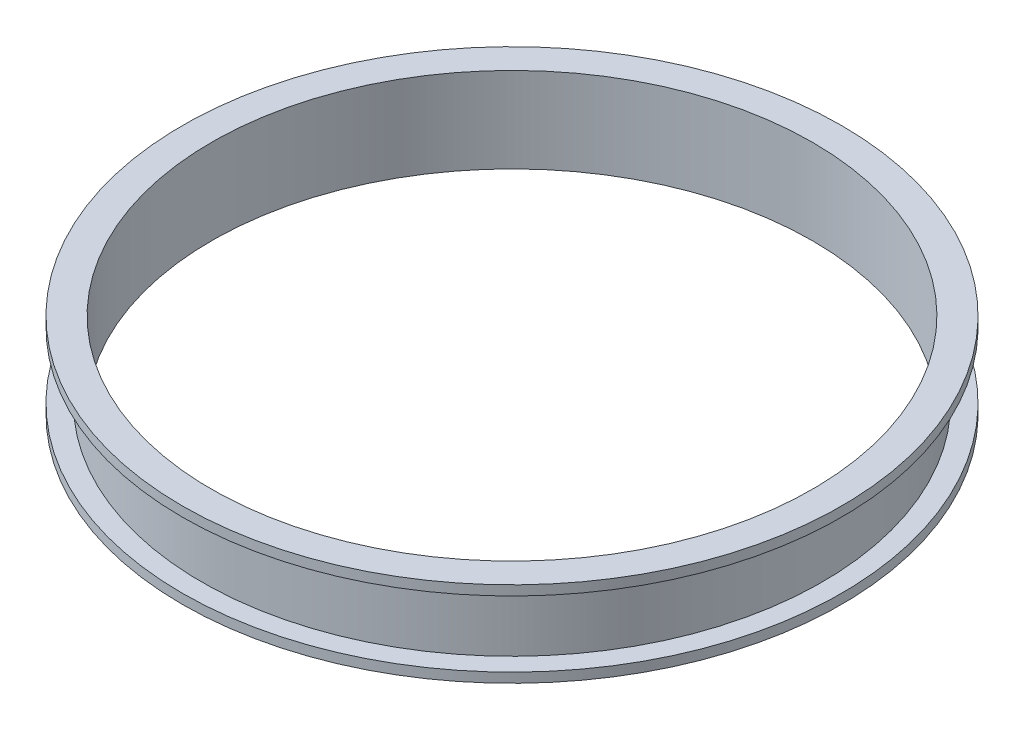
ISO-10303-21;
HEADER;
FILE_DESCRIPTION(('STEP AP214'),'2;1');
FILE_NAME('part.step','',(''),(''),'','','');
FILE_SCHEMA(('AUTOMOTIVE_DESIGN { 1 0 10303 214 1 1 1 1 }'));
ENDSEC;
DATA;
#1=APPLICATION_CONTEXT('core data for automotive mechanical design processes');
#2=APPLICATION_PROTOCOL_DEFINITION('international standard','automotive_design',2000,#1);
#3=PRODUCT_CONTEXT('',#1,'mechanical');
#4=PRODUCT('Part','Part','',(#3));
#5=PRODUCT_RELATED_PRODUCT_CATEGORY('part','',(#4));
#6=PRODUCT_DEFINITION_FORMATION('','',#4);
#7=PRODUCT_DEFINITION_CONTEXT('part definition',#1,'design');
#8=PRODUCT_DEFINITION('design','',#6,#7);
#9=PRODUCT_DEFINITION_SHAPE('','',#8);
#10=(LENGTH_UNIT() NAMED_UNIT(*) SI_UNIT(.MILLI.,.METRE.));
#11=(NAMED_UNIT(*) PLANE_ANGLE_UNIT() SI_UNIT($,.RADIAN.));
#12=(NAMED_UNIT(*) SI_UNIT($,.STERADIAN.) SOLID_ANGLE_UNIT());
#13=UNCERTAINTY_MEASURE_WITH_UNIT(LENGTH_MEASURE(1.E-05),#10,'distance_accuracy_value','');
#14=(GEOMETRIC_REPRESENTATION_CONTEXT(3) GLOBAL_UNCERTAINTY_ASSIGNED_CONTEXT((#13)) GLOBAL_UNIT_ASSIGNED_CONTEXT((#10,
#11,#12)) REPRESENTATION_CONTEXT('',''));
#15=CARTESIAN_POINT('',(0.,0.,0.));
#16=DIRECTION('',(0.,0.,1.));
#17=DIRECTION('',(1.,0.,0.));
#18=AXIS2_PLACEMENT_3D('',#15,#16,#17);
#19=CARTESIAN_POINT('',(0.,-2.5,0.));
#20=DIRECTION('',(0.,-1.,0.));
#21=DIRECTION('',(0.,0.,-1.));
#22=AXIS2_PLACEMENT_3D('',#19,#20,#21);
#23=CYLINDRICAL_SURFACE('',#22,77.5);
#24=CARTESIAN_POINT('',(0.,19.5,0.));
#25=DIRECTION('',(0.,-1.,0.));
#26=DIRECTION('',(0.,0.,-1.));
#27=AXIS2_PLACEMENT_3D('',#24,#25,#26);
#28=CIRCLE('',#27,77.5);
#29=CARTESIAN_POINT('',(0.,19.5,-77.5));
#30=VERTEX_POINT('',#29);
#31=EDGE_CURVE('E10',#30,#30,#28,.T.);
#32=ORIENTED_EDGE('',*,*,#31,.F.);
#33=EDGE_LOOP('',(#32));
#34=FACE_BOUND('',#33,.T.);
#35=CARTESIAN_POINT('',(0.,-2.5,0.));
#36=DIRECTION('',(0.,-1.,0.));
#37=DIRECTION('',(0.,0.,-1.));
#38=AXIS2_PLACEMENT_3D('',#35,#36,#37);
#39=CIRCLE('',#38,77.5);
#40=CARTESIAN_POINT('',(0.,-2.5,-77.5));
#41=VERTEX_POINT('',#40);
#42=EDGE_CURVE('E72',#41,#41,#39,.F.);
#43=ORIENTED_EDGE('',*,*,#42,.F.);
#44=EDGE_LOOP('',(#43));
#45=FACE_BOUND('',#44,.T.);
#46=ADVANCED_FACE('F37',(#34,#45),#23,.F.);
#47=CARTESIAN_POINT('',(77.5,19.5,0.));
#48=DIRECTION('',(0.,1.,0.));
#49=DIRECTION('',(0.,0.,1.));
#50=AXIS2_PLACEMENT_3D('',#47,#48,#49);
#51=PLANE('',#50);
#52=ORIENTED_EDGE('',*,*,#31,.T.);
#53=EDGE_LOOP('',(#52));
#54=FACE_BOUND('',#53,.T.);
#55=CARTESIAN_POINT('',(0.,19.5,0.));
#56=DIRECTION('',(0.,-1.,0.));
#57=DIRECTION('',(0.,0.,-1.));
#58=AXIS2_PLACEMENT_3D('',#55,#56,#57);
#59=CIRCLE('',#58,85.);
#60=CARTESIAN_POINT('',(0.,19.5,-85.));
#61=VERTEX_POINT('',#60);
#62=EDGE_CURVE('E44',#61,#61,#59,.T.);
#63=ORIENTED_EDGE('',*,*,#62,.F.);
#64=EDGE_LOOP('',(#63));
#65=FACE_BOUND('',#64,.T.);
#66=ADVANCED_FACE('F81',(#54,#65),#51,.T.);
#67=CARTESIAN_POINT('',(0.,-2.5,0.));
#68=DIRECTION('',(0.,-1.,0.));
#69=DIRECTION('',(0.,0.,-1.));
#70=AXIS2_PLACEMENT_3D('',#67,#68,#69);
#71=CYLINDRICAL_SURFACE('',#70,85.);
#72=ORIENTED_EDGE('',*,*,#62,.T.);
#73=EDGE_LOOP('',(#72));
#74=FACE_BOUND('',#73,.T.);
#75=CARTESIAN_POINT('',(0.,17.,0.));
#76=DIRECTION('',(0.,-1.,0.));
#77=DIRECTION('',(0.,0.,-1.));
#78=AXIS2_PLACEMENT_3D('',#75,#76,#77);
#79=CIRCLE('',#78,85.);
#80=CARTESIAN_POINT('',(0.,17.,-85.));
#81=VERTEX_POINT('',#80);
#82=EDGE_CURVE('E49',#81,#81,#79,.T.);
#83=ORIENTED_EDGE('',*,*,#82,.F.);
#84=EDGE_LOOP('',(#83));
#85=FACE_BOUND('',#84,.T.);
#86=ADVANCED_FACE('F86',(#74,#85),#71,.T.);
#87=CARTESIAN_POINT('',(85.,17.,0.));
#88=DIRECTION('',(0.,-1.,0.));
#89=DIRECTION('',(0.,0.,-1.));
#90=AXIS2_PLACEMENT_3D('',#87,#88,#89);
#91=PLANE('',#90);
#92=ORIENTED_EDGE('',*,*,#82,.T.);
#93=EDGE_LOOP('',(#92));
#94=FACE_BOUND('',#93,.T.);
#95=CARTESIAN_POINT('',(0.,17.,0.));
#96=DIRECTION('',(0.,-1.,0.));
#97=DIRECTION('',(0.,0.,-1.));
#98=AXIS2_PLACEMENT_3D('',#95,#96,#97);
#99=CIRCLE('',#98,80.);
#100=CARTESIAN_POINT('',(0.,17.,-80.));
#101=VERTEX_POINT('',#100);
#102=EDGE_CURVE('E54',#101,#101,#99,.T.);
#103=ORIENTED_EDGE('',*,*,#102,.F.);
#104=EDGE_LOOP('',(#103));
#105=FACE_BOUND('',#104,.T.);
#106=ADVANCED_FACE('F90',(#94,#105),#91,.T.);
#107=CARTESIAN_POINT('',(0.,-2.5,0.));
#108=DIRECTION('',(0.,-1.,0.));
#109=DIRECTION('',(0.,0.,-1.));
#110=AXIS2_PLACEMENT_3D('',#107,#108,#109);
#111=CYLINDRICAL_SURFACE('',#110,80.);
#112=ORIENTED_EDGE('',*,*,#102,.T.);
#113=EDGE_LOOP('',(#112));
#114=FACE_BOUND('',#113,.T.);
#115=CARTESIAN_POINT('',(0.,0.,0.));
#116=DIRECTION('',(0.,-1.,0.));
#117=DIRECTION('',(0.,0.,-1.));
#118=AXIS2_PLACEMENT_3D('',#115,#116,#117);
#119=CIRCLE('',#118,80.);
#120=CARTESIAN_POINT('',(0.,0.,-80.));
#121=VERTEX_POINT('',#120);
#122=EDGE_CURVE('E60',#121,#121,#119,.T.);
#123=ORIENTED_EDGE('',*,*,#122,.F.);
#124=EDGE_LOOP('',(#123));
#125=FACE_BOUND('',#124,.T.);
#126=ADVANCED_FACE('F96',(#114,#125),#111,.T.);
#127=CARTESIAN_POINT('',(80.,0.,0.));
#128=DIRECTION('',(0.,1.,0.));
#129=DIRECTION('',(0.,0.,1.));
#130=AXIS2_PLACEMENT_3D('',#127,#128,#129);
#131=PLANE('',#130);
#132=ORIENTED_EDGE('',*,*,#122,.T.);
#133=EDGE_LOOP('',(#132));
#134=FACE_BOUND('',#133,.T.);
#135=CARTESIAN_POINT('',(0.,0.,0.));
#136=DIRECTION('',(0.,-1.,0.));
#137=DIRECTION('',(0.,0.,-1.));
#138=AXIS2_PLACEMENT_3D('',#135,#136,#137);
#139=CIRCLE('',#138,85.);
#140=CARTESIAN_POINT('',(0.,0.,-85.));
#141=VERTEX_POINT('',#140);
#142=EDGE_CURVE('E64',#141,#141,#139,.T.);
#143=ORIENTED_EDGE('',*,*,#142,.F.);
#144=EDGE_LOOP('',(#143));
#145=FACE_BOUND('',#144,.T.);
#146=ADVANCED_FACE('F100',(#134,#145),#131,.T.);
#147=CARTESIAN_POINT('',(0.,-2.5,0.));
#148=DIRECTION('',(0.,-1.,0.));
#149=DIRECTION('',(0.,0.,-1.));
#150=AXIS2_PLACEMENT_3D('',#147,#148,#149);
#151=CYLINDRICAL_SURFACE('',#150,85.);
#152=ORIENTED_EDGE('',*,*,#142,.T.);
#153=EDGE_LOOP('',(#152));
#154=FACE_BOUND('',#153,.T.);
#155=CARTESIAN_POINT('',(0.,-2.5,0.));
#156=DIRECTION('',(0.,-1.,0.));
#157=DIRECTION('',(0.,0.,-1.));
#158=AXIS2_PLACEMENT_3D('',#155,#156,#157);
#159=CIRCLE('',#158,85.);
#160=CARTESIAN_POINT('',(0.,-2.5,-85.));
#161=VERTEX_POINT('',#160);
#162=EDGE_CURVE('E68',#161,#161,#159,.T.);
#163=ORIENTED_EDGE('',*,*,#162,.F.);
#164=EDGE_LOOP('',(#163));
#165=FACE_BOUND('',#164,.T.);
#166=ADVANCED_FACE('F104',(#154,#165),#151,.T.);
#167=CARTESIAN_POINT('',(85.,-2.5,0.));
#168=DIRECTION('',(0.,-1.,0.));
#169=DIRECTION('',(0.,0.,-1.));
#170=AXIS2_PLACEMENT_3D('',#167,#168,#169);
#171=PLANE('',#170);
#172=ORIENTED_EDGE('',*,*,#42,.T.);
#173=EDGE_LOOP('',(#172));
#174=FACE_BOUND('',#173,.T.);
#175=ORIENTED_EDGE('',*,*,#162,.T.);
#176=EDGE_LOOP('',(#175));
#177=FACE_BOUND('',#176,.T.);
#178=ADVANCED_FACE('F77',(#174,#177),#171,.T.);
#179=CLOSED_SHELL('',(#46,#66,#86,#106,#126,#146,#166,#178));
#180=MANIFOLD_SOLID_BREP('B2',#179);
#181=ADVANCED_BREP_SHAPE_REPRESENTATION('',(#18,#180),#14);
#182=SHAPE_DEFINITION_REPRESENTATION(#9,#181);
ENDSEC;
END-ISO-10303-21;
